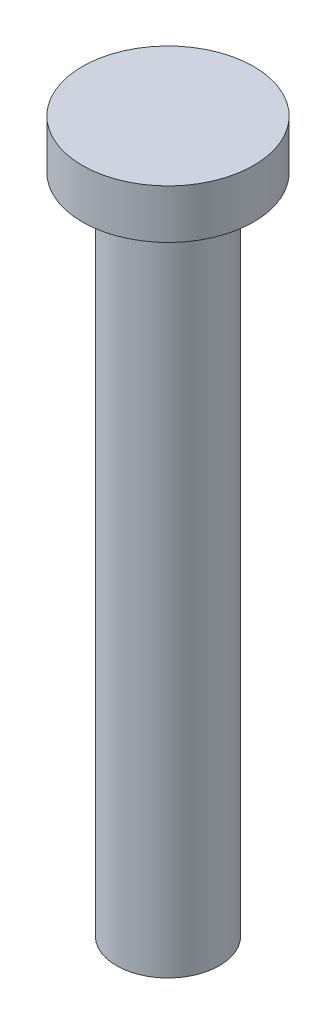
ISO-10303-21;
HEADER;
FILE_DESCRIPTION(('STEP AP214'),'2;1');
FILE_NAME('part.step','',(''),(''),'','','');
FILE_SCHEMA(('AUTOMOTIVE_DESIGN { 1 0 10303 214 1 1 1 1 }'));
ENDSEC;
DATA;
#1=APPLICATION_CONTEXT('core data for automotive mechanical design processes');
#2=APPLICATION_PROTOCOL_DEFINITION('international standard','automotive_design',2000,#1);
#3=PRODUCT_CONTEXT('',#1,'mechanical');
#4=PRODUCT('Part','Part','',(#3));
#5=PRODUCT_RELATED_PRODUCT_CATEGORY('part','',(#4));
#6=PRODUCT_DEFINITION_FORMATION('','',#4);
#7=PRODUCT_DEFINITION_CONTEXT('part definition',#1,'design');
#8=PRODUCT_DEFINITION('design','',#6,#7);
#9=PRODUCT_DEFINITION_SHAPE('','',#8);
#10=(LENGTH_UNIT() NAMED_UNIT(*) SI_UNIT(.MILLI.,.METRE.));
#11=(NAMED_UNIT(*) PLANE_ANGLE_UNIT() SI_UNIT($,.RADIAN.));
#12=(NAMED_UNIT(*) SI_UNIT($,.STERADIAN.) SOLID_ANGLE_UNIT());
#13=UNCERTAINTY_MEASURE_WITH_UNIT(LENGTH_MEASURE(1.E-05),#10,'distance_accuracy_value','');
#14=(GEOMETRIC_REPRESENTATION_CONTEXT(3) GLOBAL_UNCERTAINTY_ASSIGNED_CONTEXT((#13)) GLOBAL_UNIT_ASSIGNED_CONTEXT((#10,
#11,#12)) REPRESENTATION_CONTEXT('',''));
#15=CARTESIAN_POINT('',(0.,0.,0.));
#16=DIRECTION('',(0.,0.,1.));
#17=DIRECTION('',(1.,0.,0.));
#18=AXIS2_PLACEMENT_3D('',#15,#16,#17);
#19=CARTESIAN_POINT('',(0.,27.,0.));
#20=DIRECTION('',(0.,-1.,0.));
#21=DIRECTION('',(0.,0.,-1.));
#22=AXIS2_PLACEMENT_3D('',#19,#20,#21);
#23=CYLINDRICAL_SURFACE('',#22,2.1);
#24=CARTESIAN_POINT('',(0.,27.,0.));
#25=DIRECTION('',(0.,1.,0.));
#26=DIRECTION('',(0.,0.,1.));
#27=AXIS2_PLACEMENT_3D('',#24,#25,#26);
#28=CIRCLE('',#27,2.1);
#29=CARTESIAN_POINT('',(0.,27.,2.1));
#30=VERTEX_POINT('',#29);
#31=EDGE_CURVE('E10',#30,#30,#28,.T.);
#32=ORIENTED_EDGE('',*,*,#31,.F.);
#33=EDGE_LOOP('',(#32));
#34=FACE_BOUND('',#33,.T.);
#35=CARTESIAN_POINT('',(0.,0.,0.));
#36=DIRECTION('',(0.,1.,0.));
#37=DIRECTION('',(0.,0.,1.));
#38=AXIS2_PLACEMENT_3D('',#35,#36,#37);
#39=CIRCLE('',#38,2.1);
#40=CARTESIAN_POINT('',(0.,0.,2.1));
#41=VERTEX_POINT('',#40);
#42=EDGE_CURVE('E40',#41,#41,#39,.T.);
#43=ORIENTED_EDGE('',*,*,#42,.T.);
#44=EDGE_LOOP('',(#43));
#45=FACE_BOUND('',#44,.T.);
#46=ADVANCED_FACE('F37',(#34,#45),#23,.T.);
#47=CARTESIAN_POINT('',(0.,0.,0.));
#48=DIRECTION('',(0.,1.,0.));
#49=DIRECTION('',(0.,0.,1.));
#50=AXIS2_PLACEMENT_3D('',#47,#48,#49);
#51=PLANE('',#50);
#52=ORIENTED_EDGE('',*,*,#42,.F.);
#53=EDGE_LOOP('',(#52));
#54=FACE_BOUND('',#53,.T.);
#55=ADVANCED_FACE('F64',(#54),#51,.F.);
#56=CARTESIAN_POINT('',(0.,29.,0.));
#57=DIRECTION('',(0.,-1.,0.));
#58=DIRECTION('',(0.,0.,-1.));
#59=AXIS2_PLACEMENT_3D('',#56,#57,#58);
#60=CYLINDRICAL_SURFACE('',#59,3.5);
#61=CARTESIAN_POINT('',(0.,29.,0.));
#62=DIRECTION('',(0.,1.,0.));
#63=DIRECTION('',(0.,0.,1.));
#64=AXIS2_PLACEMENT_3D('',#61,#62,#63);
#65=CIRCLE('',#64,3.5);
#66=CARTESIAN_POINT('',(0.,29.,3.5));
#67=VERTEX_POINT('',#66);
#68=EDGE_CURVE('E49',#67,#67,#65,.T.);
#69=ORIENTED_EDGE('',*,*,#68,.F.);
#70=EDGE_LOOP('',(#69));
#71=FACE_BOUND('',#70,.T.);
#72=CARTESIAN_POINT('',(0.,27.,0.));
#73=DIRECTION('',(0.,1.,0.));
#74=DIRECTION('',(0.,0.,1.));
#75=AXIS2_PLACEMENT_3D('',#72,#73,#74);
#76=CIRCLE('',#75,3.5);
#77=CARTESIAN_POINT('',(0.,27.,3.5));
#78=VERTEX_POINT('',#77);
#79=EDGE_CURVE('E51',#78,#78,#76,.T.);
#80=ORIENTED_EDGE('',*,*,#79,.T.);
#81=EDGE_LOOP('',(#80));
#82=FACE_BOUND('',#81,.T.);
#83=ADVANCED_FACE('F61',(#71,#82),#60,.T.);
#84=CARTESIAN_POINT('',(0.,29.,0.));
#85=DIRECTION('',(0.,1.,0.));
#86=DIRECTION('',(0.,0.,1.));
#87=AXIS2_PLACEMENT_3D('',#84,#85,#86);
#88=PLANE('',#87);
#89=ORIENTED_EDGE('',*,*,#68,.T.);
#90=EDGE_LOOP('',(#89));
#91=FACE_BOUND('',#90,.T.);
#92=ADVANCED_FACE('F59',(#91),#88,.T.);
#93=CARTESIAN_POINT('',(0.,27.,0.));
#94=DIRECTION('',(0.,1.,0.));
#95=DIRECTION('',(0.,0.,1.));
#96=AXIS2_PLACEMENT_3D('',#93,#94,#95);
#97=PLANE('',#96);
#98=ORIENTED_EDGE('',*,*,#31,.T.);
#99=EDGE_LOOP('',(#98));
#100=FACE_BOUND('',#99,.T.);
#101=ORIENTED_EDGE('',*,*,#79,.F.);
#102=EDGE_LOOP('',(#101));
#103=FACE_BOUND('',#102,.T.);
#104=ADVANCED_FACE('F68',(#100,#103),#97,.F.);
#105=CLOSED_SHELL('',(#46,#55,#83,#92,#104));
#106=MANIFOLD_SOLID_BREP('B2',#105);
#107=ADVANCED_BREP_SHAPE_REPRESENTATION('',(#18,#106),#14);
#108=SHAPE_DEFINITION_REPRESENTATION(#9,#107);
ENDSEC;
END-ISO-10303-21;
